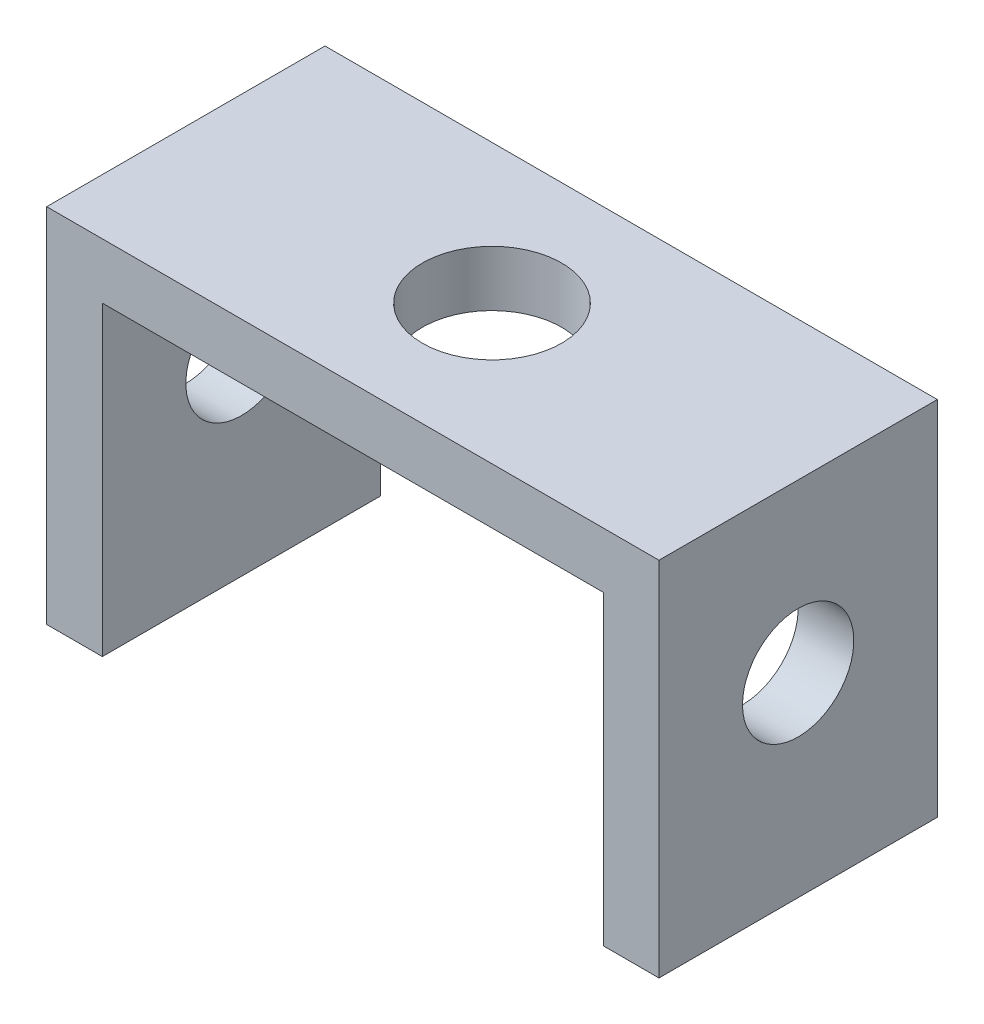
ISO-10303-21;
HEADER;
FILE_DESCRIPTION(('STEP AP214'),'2;1');
FILE_NAME('part.step','',(''),(''),'','','');
FILE_SCHEMA(('AUTOMOTIVE_DESIGN { 1 0 10303 214 1 1 1 1 }'));
ENDSEC;
DATA;
#1=APPLICATION_CONTEXT('core data for automotive mechanical design processes');
#2=APPLICATION_PROTOCOL_DEFINITION('international standard','automotive_design',2000,#1);
#3=PRODUCT_CONTEXT('',#1,'mechanical');
#4=PRODUCT('Part','Part','',(#3));
#5=PRODUCT_RELATED_PRODUCT_CATEGORY('part','',(#4));
#6=PRODUCT_DEFINITION_FORMATION('','',#4);
#7=PRODUCT_DEFINITION_CONTEXT('part definition',#1,'design');
#8=PRODUCT_DEFINITION('design','',#6,#7);
#9=PRODUCT_DEFINITION_SHAPE('','',#8);
#10=(LENGTH_UNIT() NAMED_UNIT(*) SI_UNIT(.MILLI.,.METRE.));
#11=(NAMED_UNIT(*) PLANE_ANGLE_UNIT() SI_UNIT($,.RADIAN.));
#12=(NAMED_UNIT(*) SI_UNIT($,.STERADIAN.) SOLID_ANGLE_UNIT());
#13=UNCERTAINTY_MEASURE_WITH_UNIT(LENGTH_MEASURE(1.E-05),#10,'distance_accuracy_value','');
#14=(GEOMETRIC_REPRESENTATION_CONTEXT(3) GLOBAL_UNCERTAINTY_ASSIGNED_CONTEXT((#13)) GLOBAL_UNIT_ASSIGNED_CONTEXT((#10,
#11,#12)) REPRESENTATION_CONTEXT('',''));
#15=CARTESIAN_POINT('',(0.,0.,0.));
#16=DIRECTION('',(0.,0.,1.));
#17=DIRECTION('',(1.,0.,0.));
#18=AXIS2_PLACEMENT_3D('',#15,#16,#17);
#19=CARTESIAN_POINT('',(0.,0.,0.));
#20=DIRECTION('',(0.,1.,0.));
#21=DIRECTION('',(0.,0.,1.));
#22=AXIS2_PLACEMENT_3D('',#19,#20,#21);
#23=PLANE('',#22);
#24=CARTESIAN_POINT('',(0.,0.,0.));
#25=DIRECTION('',(0.,1.,0.));
#26=DIRECTION('',(0.,0.,1.));
#27=AXIS2_PLACEMENT_3D('',#24,#25,#26);
#28=CIRCLE('',#27,12.5);
#29=CARTESIAN_POINT('',(0.,0.,12.5));
#30=VERTEX_POINT('',#29);
#31=EDGE_CURVE('E173',#30,#30,#28,.T.);
#32=ORIENTED_EDGE('',*,*,#31,.T.);
#33=EDGE_LOOP('',(#32));
#34=FACE_BOUND('',#33,.T.);
#35=DIRECTION('',(1.,0.,0.));
#36=VECTOR('',#35,1.);
#37=CARTESIAN_POINT('',(-55.,0.,25.));
#38=LINE('',#37,#36);
#39=CARTESIAN_POINT('',(-45.,0.,25.));
#40=VERTEX_POINT('',#39);
#41=CARTESIAN_POINT('',(45.,0.,25.));
#42=VERTEX_POINT('',#41);
#43=EDGE_CURVE('E178',#40,#42,#38,.T.);
#44=ORIENTED_EDGE('',*,*,#43,.F.);
#45=DIRECTION('',(0.,0.,-1.));
#46=VECTOR('',#45,1.);
#47=CARTESIAN_POINT('',(-45.,0.,0.));
#48=LINE('',#47,#46);
#49=CARTESIAN_POINT('',(-45.,0.,-25.));
#50=VERTEX_POINT('',#49);
#51=EDGE_CURVE('E111',#40,#50,#48,.T.);
#52=ORIENTED_EDGE('',*,*,#51,.T.);
#53=DIRECTION('',(-1.,0.,0.));
#54=VECTOR('',#53,1.);
#55=CARTESIAN_POINT('',(-55.,0.,-25.));
#56=LINE('',#55,#54);
#57=CARTESIAN_POINT('',(45.,0.,-25.));
#58=VERTEX_POINT('',#57);
#59=EDGE_CURVE('E186',#58,#50,#56,.T.);
#60=ORIENTED_EDGE('',*,*,#59,.F.);
#61=DIRECTION('',(0.,0.,-1.));
#62=VECTOR('',#61,1.);
#63=CARTESIAN_POINT('',(45.,0.,0.));
#64=LINE('',#63,#62);
#65=EDGE_CURVE('E167',#42,#58,#64,.T.);
#66=ORIENTED_EDGE('',*,*,#65,.F.);
#67=EDGE_LOOP('',(#44,#52,#60,#66));
#68=FACE_BOUND('',#67,.T.);
#69=ADVANCED_FACE('F39',(#34,#68),#23,.F.);
#70=CARTESIAN_POINT('',(0.,10.,0.));
#71=DIRECTION('',(0.,1.,0.));
#72=DIRECTION('',(0.,0.,1.));
#73=AXIS2_PLACEMENT_3D('',#70,#71,#72);
#74=PLANE('',#73);
#75=DIRECTION('',(-1.,0.,0.));
#76=VECTOR('',#75,1.);
#77=CARTESIAN_POINT('',(-55.,10.,-25.));
#78=LINE('',#77,#76);
#79=CARTESIAN_POINT('',(55.,10.,-25.));
#80=VERTEX_POINT('',#79);
#81=CARTESIAN_POINT('',(-55.,10.,-25.));
#82=VERTEX_POINT('',#81);
#83=EDGE_CURVE('E63',#80,#82,#78,.T.);
#84=ORIENTED_EDGE('',*,*,#83,.T.);
#85=DIRECTION('',(0.,0.,1.));
#86=VECTOR('',#85,1.);
#87=CARTESIAN_POINT('',(-55.,10.,-25.));
#88=LINE('',#87,#86);
#89=CARTESIAN_POINT('',(-55.,10.,25.));
#90=VERTEX_POINT('',#89);
#91=EDGE_CURVE('E182',#82,#90,#88,.T.);
#92=ORIENTED_EDGE('',*,*,#91,.T.);
#93=DIRECTION('',(1.,0.,0.));
#94=VECTOR('',#93,1.);
#95=CARTESIAN_POINT('',(-55.,10.,25.));
#96=LINE('',#95,#94);
#97=CARTESIAN_POINT('',(55.,10.,25.));
#98=VERTEX_POINT('',#97);
#99=EDGE_CURVE('E185',#90,#98,#96,.T.);
#100=ORIENTED_EDGE('',*,*,#99,.T.);
#101=DIRECTION('',(0.,0.,-1.));
#102=VECTOR('',#101,1.);
#103=CARTESIAN_POINT('',(55.,10.,-25.));
#104=LINE('',#103,#102);
#105=EDGE_CURVE('E189',#98,#80,#104,.T.);
#106=ORIENTED_EDGE('',*,*,#105,.T.);
#107=EDGE_LOOP('',(#84,#92,#100,#106));
#108=FACE_BOUND('',#107,.T.);
#109=CARTESIAN_POINT('',(0.,10.,0.));
#110=DIRECTION('',(0.,1.,0.));
#111=DIRECTION('',(0.,0.,1.));
#112=AXIS2_PLACEMENT_3D('',#109,#110,#111);
#113=CIRCLE('',#112,12.5);
#114=CARTESIAN_POINT('',(0.,10.,12.5));
#115=VERTEX_POINT('',#114);
#116=EDGE_CURVE('E174',#115,#115,#113,.T.);
#117=ORIENTED_EDGE('',*,*,#116,.F.);
#118=EDGE_LOOP('',(#117));
#119=FACE_BOUND('',#118,.T.);
#120=ADVANCED_FACE('F246',(#108,#119),#74,.T.);
#121=CARTESIAN_POINT('',(-55.,10.,-25.));
#122=DIRECTION('',(1.,0.,0.));
#123=DIRECTION('',(0.,0.,-1.));
#124=AXIS2_PLACEMENT_3D('',#121,#122,#123);
#125=PLANE('',#124);
#126=DIRECTION('',(0.,-1.,0.));
#127=VECTOR('',#126,1.);
#128=CARTESIAN_POINT('',(-55.,10.,-25.));
#129=LINE('',#128,#127);
#130=CARTESIAN_POINT('',(-55.,-55.,-25.));
#131=VERTEX_POINT('',#130);
#132=EDGE_CURVE('E194',#82,#131,#129,.T.);
#133=ORIENTED_EDGE('',*,*,#132,.T.);
#134=DIRECTION('',(0.,0.,-1.));
#135=VECTOR('',#134,1.);
#136=CARTESIAN_POINT('',(-55.,-55.,-25.));
#137=LINE('',#136,#135);
#138=CARTESIAN_POINT('',(-55.,-55.,25.));
#139=VERTEX_POINT('',#138);
#140=EDGE_CURVE('E116',#139,#131,#137,.T.);
#141=ORIENTED_EDGE('',*,*,#140,.F.);
#142=DIRECTION('',(0.,-1.,0.));
#143=VECTOR('',#142,1.);
#144=CARTESIAN_POINT('',(-55.,10.,25.));
#145=LINE('',#144,#143);
#146=EDGE_CURVE('E11',#90,#139,#145,.T.);
#147=ORIENTED_EDGE('',*,*,#146,.F.);
#148=ORIENTED_EDGE('',*,*,#91,.F.);
#149=EDGE_LOOP('',(#133,#141,#147,#148));
#150=FACE_BOUND('',#149,.T.);
#151=CARTESIAN_POINT('',(-55.,-20.,0.));
#152=DIRECTION('',(1.,0.,0.));
#153=DIRECTION('',(0.,0.,-1.));
#154=AXIS2_PLACEMENT_3D('',#151,#152,#153);
#155=CIRCLE('',#154,10.);
#156=CARTESIAN_POINT('',(-55.,-20.,-10.));
#157=VERTEX_POINT('',#156);
#158=EDGE_CURVE('E227',#157,#157,#155,.T.);
#159=ORIENTED_EDGE('',*,*,#158,.T.);
#160=EDGE_LOOP('',(#159));
#161=FACE_BOUND('',#160,.T.);
#162=ADVANCED_FACE('F41',(#150,#161),#125,.F.);
#163=CARTESIAN_POINT('',(-55.,10.,25.));
#164=DIRECTION('',(0.,0.,-1.));
#165=DIRECTION('',(-1.,0.,0.));
#166=AXIS2_PLACEMENT_3D('',#163,#164,#165);
#167=PLANE('',#166);
#168=DIRECTION('',(0.,-1.,0.));
#169=VECTOR('',#168,1.);
#170=CARTESIAN_POINT('',(55.,10.,25.));
#171=LINE('',#170,#169);
#172=CARTESIAN_POINT('',(55.,-55.,25.));
#173=VERTEX_POINT('',#172);
#174=EDGE_CURVE('E48',#98,#173,#171,.T.);
#175=ORIENTED_EDGE('',*,*,#174,.F.);
#176=ORIENTED_EDGE('',*,*,#99,.F.);
#177=ORIENTED_EDGE('',*,*,#146,.T.);
#178=DIRECTION('',(-1.,0.,0.));
#179=VECTOR('',#178,1.);
#180=CARTESIAN_POINT('',(-45.,-55.,25.));
#181=LINE('',#180,#179);
#182=CARTESIAN_POINT('',(-45.,-55.,25.));
#183=VERTEX_POINT('',#182);
#184=EDGE_CURVE('E122',#183,#139,#181,.T.);
#185=ORIENTED_EDGE('',*,*,#184,.F.);
#186=DIRECTION('',(0.,-1.,0.));
#187=VECTOR('',#186,1.);
#188=CARTESIAN_POINT('',(-45.,10.,25.));
#189=LINE('',#188,#187);
#190=EDGE_CURVE('E105',#40,#183,#189,.T.);
#191=ORIENTED_EDGE('',*,*,#190,.F.);
#192=ORIENTED_EDGE('',*,*,#43,.T.);
#193=DIRECTION('',(0.,-1.,0.));
#194=VECTOR('',#193,1.);
#195=CARTESIAN_POINT('',(45.,10.,25.));
#196=LINE('',#195,#194);
#197=CARTESIAN_POINT('',(45.,-55.,25.));
#198=VERTEX_POINT('',#197);
#199=EDGE_CURVE('E150',#42,#198,#196,.T.);
#200=ORIENTED_EDGE('',*,*,#199,.T.);
#201=DIRECTION('',(1.,0.,0.));
#202=VECTOR('',#201,1.);
#203=CARTESIAN_POINT('',(45.,-55.,25.));
#204=LINE('',#203,#202);
#205=EDGE_CURVE('E159',#198,#173,#204,.T.);
#206=ORIENTED_EDGE('',*,*,#205,.T.);
#207=EDGE_LOOP('',(#175,#176,#177,#185,#191,#192,#200,#206));
#208=FACE_BOUND('',#207,.T.);
#209=ADVANCED_FACE('F130',(#208),#167,.F.);
#210=CARTESIAN_POINT('',(55.,10.,-25.));
#211=DIRECTION('',(-1.,0.,0.));
#212=DIRECTION('',(0.,0.,1.));
#213=AXIS2_PLACEMENT_3D('',#210,#211,#212);
#214=PLANE('',#213);
#215=ORIENTED_EDGE('',*,*,#174,.T.);
#216=DIRECTION('',(0.,0.,-1.));
#217=VECTOR('',#216,1.);
#218=CARTESIAN_POINT('',(55.,-55.,-25.));
#219=LINE('',#218,#217);
#220=CARTESIAN_POINT('',(55.,-55.,-25.));
#221=VERTEX_POINT('',#220);
#222=EDGE_CURVE('E146',#173,#221,#219,.T.);
#223=ORIENTED_EDGE('',*,*,#222,.T.);
#224=DIRECTION('',(0.,-1.,0.));
#225=VECTOR('',#224,1.);
#226=CARTESIAN_POINT('',(55.,10.,-25.));
#227=LINE('',#226,#225);
#228=EDGE_CURVE('E201',#80,#221,#227,.T.);
#229=ORIENTED_EDGE('',*,*,#228,.F.);
#230=ORIENTED_EDGE('',*,*,#105,.F.);
#231=EDGE_LOOP('',(#215,#223,#229,#230));
#232=FACE_BOUND('',#231,.T.);
#233=CARTESIAN_POINT('',(55.,-20.,0.));
#234=DIRECTION('',(-1.,0.,0.));
#235=DIRECTION('',(0.,0.,1.));
#236=AXIS2_PLACEMENT_3D('',#233,#234,#235);
#237=CIRCLE('',#236,10.);
#238=CARTESIAN_POINT('',(55.,-20.,10.));
#239=VERTEX_POINT('',#238);
#240=EDGE_CURVE('E137',#239,#239,#237,.T.);
#241=ORIENTED_EDGE('',*,*,#240,.T.);
#242=EDGE_LOOP('',(#241));
#243=FACE_BOUND('',#242,.T.);
#244=ADVANCED_FACE('F206',(#232,#243),#214,.F.);
#245=CARTESIAN_POINT('',(-55.,10.,-25.));
#246=DIRECTION('',(0.,0.,1.));
#247=DIRECTION('',(1.,0.,0.));
#248=AXIS2_PLACEMENT_3D('',#245,#246,#247);
#249=PLANE('',#248);
#250=ORIENTED_EDGE('',*,*,#59,.T.);
#251=DIRECTION('',(0.,1.,0.));
#252=VECTOR('',#251,1.);
#253=CARTESIAN_POINT('',(-45.,10.,-25.));
#254=LINE('',#253,#252);
#255=CARTESIAN_POINT('',(-45.,-55.,-25.));
#256=VERTEX_POINT('',#255);
#257=EDGE_CURVE('E127',#256,#50,#254,.T.);
#258=ORIENTED_EDGE('',*,*,#257,.F.);
#259=DIRECTION('',(-1.,0.,0.));
#260=VECTOR('',#259,1.);
#261=CARTESIAN_POINT('',(-45.,-55.,-25.));
#262=LINE('',#261,#260);
#263=EDGE_CURVE('E124',#256,#131,#262,.T.);
#264=ORIENTED_EDGE('',*,*,#263,.T.);
#265=ORIENTED_EDGE('',*,*,#132,.F.);
#266=ORIENTED_EDGE('',*,*,#83,.F.);
#267=ORIENTED_EDGE('',*,*,#228,.T.);
#268=DIRECTION('',(1.,0.,0.));
#269=VECTOR('',#268,1.);
#270=CARTESIAN_POINT('',(45.,-55.,-25.));
#271=LINE('',#270,#269);
#272=CARTESIAN_POINT('',(45.,-55.,-25.));
#273=VERTEX_POINT('',#272);
#274=EDGE_CURVE('E163',#273,#221,#271,.T.);
#275=ORIENTED_EDGE('',*,*,#274,.F.);
#276=DIRECTION('',(0.,1.,0.));
#277=VECTOR('',#276,1.);
#278=CARTESIAN_POINT('',(45.,10.,-25.));
#279=LINE('',#278,#277);
#280=EDGE_CURVE('E55',#273,#58,#279,.T.);
#281=ORIENTED_EDGE('',*,*,#280,.T.);
#282=EDGE_LOOP('',(#250,#258,#264,#265,#266,#267,#275,#281));
#283=FACE_BOUND('',#282,.T.);
#284=ADVANCED_FACE('F215',(#283),#249,.F.);
#285=CARTESIAN_POINT('',(0.,10.,0.));
#286=DIRECTION('',(0.,-1.,0.));
#287=DIRECTION('',(0.,0.,-1.));
#288=AXIS2_PLACEMENT_3D('',#285,#286,#287);
#289=CYLINDRICAL_SURFACE('',#288,12.5);
#290=ORIENTED_EDGE('',*,*,#116,.T.);
#291=EDGE_LOOP('',(#290));
#292=FACE_BOUND('',#291,.T.);
#293=ORIENTED_EDGE('',*,*,#31,.F.);
#294=EDGE_LOOP('',(#293));
#295=FACE_BOUND('',#294,.T.);
#296=ADVANCED_FACE('F257',(#292,#295),#289,.F.);
#297=CARTESIAN_POINT('',(45.,0.,0.));
#298=DIRECTION('',(1.,0.,0.));
#299=DIRECTION('',(0.,0.,-1.));
#300=AXIS2_PLACEMENT_3D('',#297,#298,#299);
#301=PLANE('',#300);
#302=CARTESIAN_POINT('',(45.,-20.,0.));
#303=DIRECTION('',(-1.,0.,0.));
#304=DIRECTION('',(0.,0.,1.));
#305=AXIS2_PLACEMENT_3D('',#302,#303,#304);
#306=CIRCLE('',#305,10.);
#307=CARTESIAN_POINT('',(45.,-20.,10.));
#308=VERTEX_POINT('',#307);
#309=EDGE_CURVE('E142',#308,#308,#306,.T.);
#310=ORIENTED_EDGE('',*,*,#309,.F.);
#311=EDGE_LOOP('',(#310));
#312=FACE_BOUND('',#311,.T.);
#313=ORIENTED_EDGE('',*,*,#199,.F.);
#314=ORIENTED_EDGE('',*,*,#65,.T.);
#315=ORIENTED_EDGE('',*,*,#280,.F.);
#316=DIRECTION('',(0.,0.,-1.));
#317=VECTOR('',#316,1.);
#318=CARTESIAN_POINT('',(45.,-55.,-25.));
#319=LINE('',#318,#317);
#320=EDGE_CURVE('E153',#198,#273,#319,.T.);
#321=ORIENTED_EDGE('',*,*,#320,.F.);
#322=EDGE_LOOP('',(#313,#314,#315,#321));
#323=FACE_BOUND('',#322,.T.);
#324=ADVANCED_FACE('F217',(#312,#323),#301,.F.);
#325=CARTESIAN_POINT('',(45.,-55.,-25.));
#326=DIRECTION('',(0.,-1.,0.));
#327=DIRECTION('',(0.,0.,-1.));
#328=AXIS2_PLACEMENT_3D('',#325,#326,#327);
#329=PLANE('',#328);
#330=ORIENTED_EDGE('',*,*,#222,.F.);
#331=ORIENTED_EDGE('',*,*,#205,.F.);
#332=ORIENTED_EDGE('',*,*,#320,.T.);
#333=ORIENTED_EDGE('',*,*,#274,.T.);
#334=EDGE_LOOP('',(#330,#331,#332,#333));
#335=FACE_BOUND('',#334,.T.);
#336=ADVANCED_FACE('F214',(#335),#329,.T.);
#337=CARTESIAN_POINT('',(45.,-20.,0.));
#338=DIRECTION('',(1.,0.,0.));
#339=DIRECTION('',(0.,0.,-1.));
#340=AXIS2_PLACEMENT_3D('',#337,#338,#339);
#341=CYLINDRICAL_SURFACE('',#340,10.);
#342=ORIENTED_EDGE('',*,*,#309,.T.);
#343=EDGE_LOOP('',(#342));
#344=FACE_BOUND('',#343,.T.);
#345=ORIENTED_EDGE('',*,*,#240,.F.);
#346=EDGE_LOOP('',(#345));
#347=FACE_BOUND('',#346,.T.);
#348=ADVANCED_FACE('F280',(#344,#347),#341,.F.);
#349=CARTESIAN_POINT('',(-45.,0.,0.));
#350=DIRECTION('',(1.,0.,0.));
#351=DIRECTION('',(0.,0.,-1.));
#352=AXIS2_PLACEMENT_3D('',#349,#350,#351);
#353=PLANE('',#352);
#354=CARTESIAN_POINT('',(-45.,-20.,0.));
#355=DIRECTION('',(1.,0.,0.));
#356=DIRECTION('',(0.,0.,-1.));
#357=AXIS2_PLACEMENT_3D('',#354,#355,#356);
#358=CIRCLE('',#357,10.);
#359=CARTESIAN_POINT('',(-45.,-20.,-10.));
#360=VERTEX_POINT('',#359);
#361=EDGE_CURVE('E224',#360,#360,#358,.T.);
#362=ORIENTED_EDGE('',*,*,#361,.F.);
#363=EDGE_LOOP('',(#362));
#364=FACE_BOUND('',#363,.T.);
#365=ORIENTED_EDGE('',*,*,#51,.F.);
#366=ORIENTED_EDGE('',*,*,#190,.T.);
#367=DIRECTION('',(0.,0.,-1.));
#368=VECTOR('',#367,1.);
#369=CARTESIAN_POINT('',(-45.,-55.,-25.));
#370=LINE('',#369,#368);
#371=EDGE_CURVE('E108',#183,#256,#370,.T.);
#372=ORIENTED_EDGE('',*,*,#371,.T.);
#373=ORIENTED_EDGE('',*,*,#257,.T.);
#374=EDGE_LOOP('',(#365,#366,#372,#373));
#375=FACE_BOUND('',#374,.T.);
#376=ADVANCED_FACE('F107',(#364,#375),#353,.T.);
#377=CARTESIAN_POINT('',(-45.,-55.,-25.));
#378=DIRECTION('',(0.,1.,0.));
#379=DIRECTION('',(0.,0.,1.));
#380=AXIS2_PLACEMENT_3D('',#377,#378,#379);
#381=PLANE('',#380);
#382=ORIENTED_EDGE('',*,*,#140,.T.);
#383=ORIENTED_EDGE('',*,*,#263,.F.);
#384=ORIENTED_EDGE('',*,*,#371,.F.);
#385=ORIENTED_EDGE('',*,*,#184,.T.);
#386=EDGE_LOOP('',(#382,#383,#384,#385));
#387=FACE_BOUND('',#386,.T.);
#388=ADVANCED_FACE('F121',(#387),#381,.F.);
#389=CARTESIAN_POINT('',(-45.,-20.,0.));
#390=DIRECTION('',(-1.,0.,0.));
#391=DIRECTION('',(0.,0.,1.));
#392=AXIS2_PLACEMENT_3D('',#389,#390,#391);
#393=CYLINDRICAL_SURFACE('',#392,10.);
#394=ORIENTED_EDGE('',*,*,#361,.T.);
#395=EDGE_LOOP('',(#394));
#396=FACE_BOUND('',#395,.T.);
#397=ORIENTED_EDGE('',*,*,#158,.F.);
#398=EDGE_LOOP('',(#397));
#399=FACE_BOUND('',#398,.T.);
#400=ADVANCED_FACE('F237',(#396,#399),#393,.F.);
#401=CLOSED_SHELL('',(#69,#120,#162,#209,#244,#284,#296,#324,#336,#348,#376,#388,#400));
#402=MANIFOLD_SOLID_BREP('B2',#401);
#403=ADVANCED_BREP_SHAPE_REPRESENTATION('',(#18,#402),#14);
#404=SHAPE_DEFINITION_REPRESENTATION(#9,#403);
ENDSEC;
END-ISO-10303-21;
